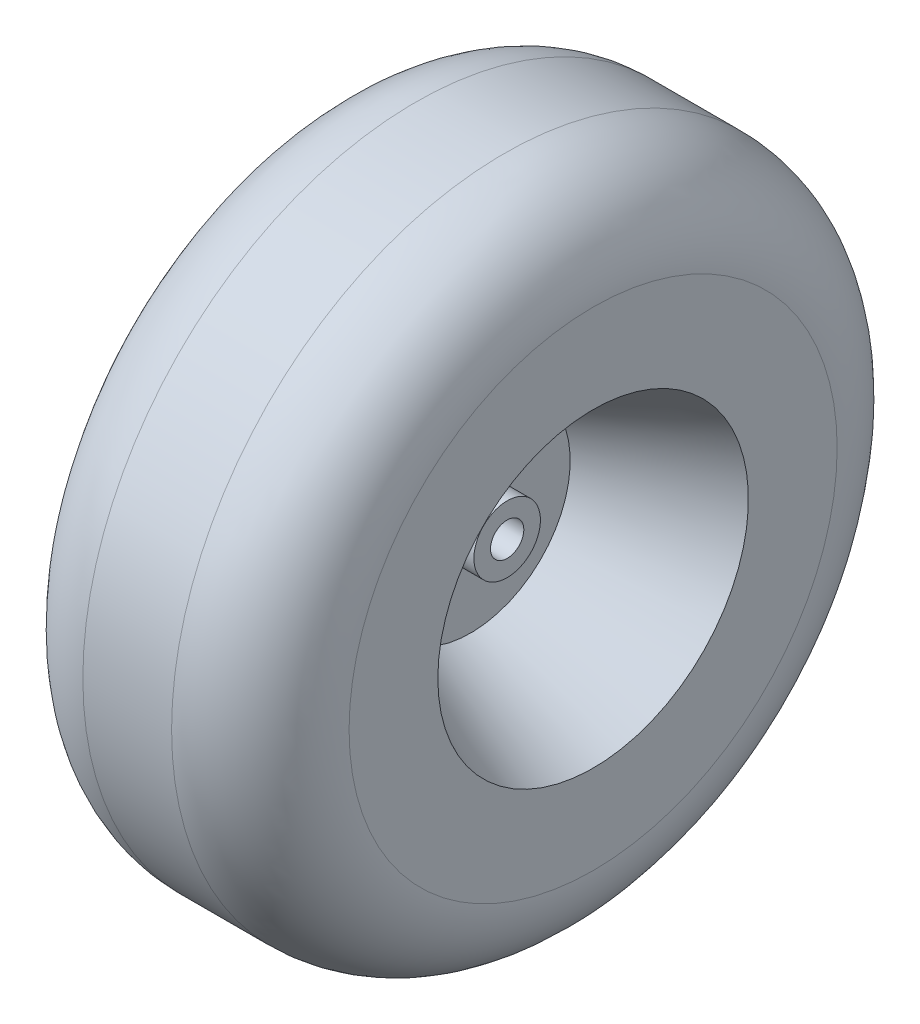
ISO-10303-21;
HEADER;
FILE_DESCRIPTION(('STEP AP214'),'2;1');
FILE_NAME('part.step','',(''),(''),'','','');
FILE_SCHEMA(('AUTOMOTIVE_DESIGN { 1 0 10303 214 1 1 1 1 }'));
ENDSEC;
DATA;
#1=APPLICATION_CONTEXT('core data for automotive mechanical design processes');
#2=APPLICATION_PROTOCOL_DEFINITION('international standard','automotive_design',2000,#1);
#3=PRODUCT_CONTEXT('',#1,'mechanical');
#4=PRODUCT('Part','Part','',(#3));
#5=PRODUCT_RELATED_PRODUCT_CATEGORY('part','',(#4));
#6=PRODUCT_DEFINITION_FORMATION('','',#4);
#7=PRODUCT_DEFINITION_CONTEXT('part definition',#1,'design');
#8=PRODUCT_DEFINITION('design','',#6,#7);
#9=PRODUCT_DEFINITION_SHAPE('','',#8);
#10=(LENGTH_UNIT() NAMED_UNIT(*) SI_UNIT(.MILLI.,.METRE.));
#11=(NAMED_UNIT(*) PLANE_ANGLE_UNIT() SI_UNIT($,.RADIAN.));
#12=(NAMED_UNIT(*) SI_UNIT($,.STERADIAN.) SOLID_ANGLE_UNIT());
#13=UNCERTAINTY_MEASURE_WITH_UNIT(LENGTH_MEASURE(1.E-05),#10,'distance_accuracy_value','');
#14=(GEOMETRIC_REPRESENTATION_CONTEXT(3) GLOBAL_UNCERTAINTY_ASSIGNED_CONTEXT((#13)) GLOBAL_UNIT_ASSIGNED_CONTEXT((#10,
#11,#12)) REPRESENTATION_CONTEXT('',''));
#15=CARTESIAN_POINT('',(0.,0.,0.));
#16=DIRECTION('',(0.,0.,1.));
#17=DIRECTION('',(1.,0.,0.));
#18=AXIS2_PLACEMENT_3D('',#15,#16,#17);
#19=CARTESIAN_POINT('',(76.2,88.9,0.));
#20=DIRECTION('',(-1.,0.,0.));
#21=DIRECTION('',(0.,0.,1.));
#22=AXIS2_PLACEMENT_3D('',#19,#20,#21);
#23=PLANE('',#22);
#24=CARTESIAN_POINT('',(76.2,0.,0.));
#25=DIRECTION('',(-1.,0.,0.));
#26=DIRECTION('',(0.,0.,1.));
#27=AXIS2_PLACEMENT_3D('',#24,#25,#26);
#28=CIRCLE('',#27,139.7);
#29=CARTESIAN_POINT('',(76.2,0.,139.7));
#30=VERTEX_POINT('',#29);
#31=EDGE_CURVE('E80',#30,#30,#28,.T.);
#32=ORIENTED_EDGE('',*,*,#31,.F.);
#33=EDGE_LOOP('',(#32));
#34=FACE_BOUND('',#33,.T.);
#35=CARTESIAN_POINT('',(76.2,0.,0.));
#36=DIRECTION('',(-1.,0.,0.));
#37=DIRECTION('',(0.,0.,1.));
#38=AXIS2_PLACEMENT_3D('',#35,#36,#37);
#39=CIRCLE('',#38,88.9);
#40=CARTESIAN_POINT('',(76.2,0.,88.9));
#41=VERTEX_POINT('',#40);
#42=EDGE_CURVE('E10',#41,#41,#39,.T.);
#43=ORIENTED_EDGE('',*,*,#42,.T.);
#44=EDGE_LOOP('',(#43));
#45=FACE_BOUND('',#44,.T.);
#46=ADVANCED_FACE('F34',(#34,#45),#23,.F.);
#47=CARTESIAN_POINT('',(6.11263969154835,0.,0.));
#48=DIRECTION('',(1.,0.,0.));
#49=DIRECTION('',(0.,0.,-1.));
#50=AXIS2_PLACEMENT_3D('',#47,#48,#49);
#51=CONICAL_SURFACE('',#50,56.9745874149852,0.427425630126478);
#52=ORIENTED_EDGE('',*,*,#42,.F.);
#53=EDGE_LOOP('',(#52));
#54=FACE_BOUND('',#53,.T.);
#55=CARTESIAN_POINT('',(6.11263969154835,0.,0.));
#56=DIRECTION('',(-1.,0.,0.));
#57=DIRECTION('',(0.,0.,1.));
#58=AXIS2_PLACEMENT_3D('',#55,#56,#57);
#59=CIRCLE('',#58,56.9745874149852);
#60=CARTESIAN_POINT('',(6.11263969154835,0.,56.9745874149852));
#61=VERTEX_POINT('',#60);
#62=EDGE_CURVE('E40',#61,#61,#59,.T.);
#63=ORIENTED_EDGE('',*,*,#62,.T.);
#64=EDGE_LOOP('',(#63));
#65=FACE_BOUND('',#64,.T.);
#66=ADVANCED_FACE('F87',(#54,#65),#51,.F.);
#67=CARTESIAN_POINT('',(6.11263969154835,19.05,0.));
#68=DIRECTION('',(-1.,0.,0.));
#69=DIRECTION('',(0.,0.,1.));
#70=AXIS2_PLACEMENT_3D('',#67,#68,#69);
#71=PLANE('',#70);
#72=ORIENTED_EDGE('',*,*,#62,.F.);
#73=EDGE_LOOP('',(#72));
#74=FACE_BOUND('',#73,.T.);
#75=CARTESIAN_POINT('',(6.11263969154835,0.,0.));
#76=DIRECTION('',(-1.,0.,0.));
#77=DIRECTION('',(0.,0.,1.));
#78=AXIS2_PLACEMENT_3D('',#75,#76,#77);
#79=CIRCLE('',#78,19.05);
#80=CARTESIAN_POINT('',(6.11263969154835,0.,19.05));
#81=VERTEX_POINT('',#80);
#82=EDGE_CURVE('E44',#81,#81,#79,.T.);
#83=ORIENTED_EDGE('',*,*,#82,.T.);
#84=EDGE_LOOP('',(#83));
#85=FACE_BOUND('',#84,.T.);
#86=ADVANCED_FACE('F91',(#74,#85),#71,.F.);
#87=CARTESIAN_POINT('',(-76.2,0.,0.));
#88=DIRECTION('',(-1.,0.,0.));
#89=DIRECTION('',(0.,0.,1.));
#90=AXIS2_PLACEMENT_3D('',#87,#88,#89);
#91=CYLINDRICAL_SURFACE('',#90,19.05);
#92=ORIENTED_EDGE('',*,*,#82,.F.);
#93=EDGE_LOOP('',(#92));
#94=FACE_BOUND('',#93,.T.);
#95=CARTESIAN_POINT('',(26.9875,0.,0.));
#96=DIRECTION('',(-1.,0.,0.));
#97=DIRECTION('',(0.,0.,1.));
#98=AXIS2_PLACEMENT_3D('',#95,#96,#97);
#99=CIRCLE('',#98,19.05);
#100=CARTESIAN_POINT('',(26.9875,0.,19.05));
#101=VERTEX_POINT('',#100);
#102=EDGE_CURVE('E48',#101,#101,#99,.T.);
#103=ORIENTED_EDGE('',*,*,#102,.T.);
#104=EDGE_LOOP('',(#103));
#105=FACE_BOUND('',#104,.T.);
#106=ADVANCED_FACE('F96',(#94,#105),#91,.T.);
#107=CARTESIAN_POINT('',(26.9875,9.52500000000001,0.));
#108=DIRECTION('',(-1.,0.,0.));
#109=DIRECTION('',(0.,0.,1.));
#110=AXIS2_PLACEMENT_3D('',#107,#108,#109);
#111=PLANE('',#110);
#112=ORIENTED_EDGE('',*,*,#102,.F.);
#113=EDGE_LOOP('',(#112));
#114=FACE_BOUND('',#113,.T.);
#115=CARTESIAN_POINT('',(26.9875,0.,0.));
#116=DIRECTION('',(-1.,0.,0.));
#117=DIRECTION('',(0.,0.,1.));
#118=AXIS2_PLACEMENT_3D('',#115,#116,#117);
#119=CIRCLE('',#118,9.52500000000001);
#120=CARTESIAN_POINT('',(26.9875,0.,9.52500000000001));
#121=VERTEX_POINT('',#120);
#122=EDGE_CURVE('E53',#121,#121,#119,.T.);
#123=ORIENTED_EDGE('',*,*,#122,.T.);
#124=EDGE_LOOP('',(#123));
#125=FACE_BOUND('',#124,.T.);
#126=ADVANCED_FACE('F102',(#114,#125),#111,.F.);
#127=CARTESIAN_POINT('',(-76.2,0.,0.));
#128=DIRECTION('',(-1.,0.,0.));
#129=DIRECTION('',(0.,0.,1.));
#130=AXIS2_PLACEMENT_3D('',#127,#128,#129);
#131=CYLINDRICAL_SURFACE('',#130,9.52500000000001);
#132=ORIENTED_EDGE('',*,*,#122,.F.);
#133=EDGE_LOOP('',(#132));
#134=FACE_BOUND('',#133,.T.);
#135=CARTESIAN_POINT('',(-26.9875,0.,0.));
#136=DIRECTION('',(-1.,0.,0.));
#137=DIRECTION('',(0.,0.,1.));
#138=AXIS2_PLACEMENT_3D('',#135,#136,#137);
#139=CIRCLE('',#138,9.52500000000001);
#140=CARTESIAN_POINT('',(-26.9875,0.,9.52500000000001));
#141=VERTEX_POINT('',#140);
#142=EDGE_CURVE('E56',#141,#141,#139,.T.);
#143=ORIENTED_EDGE('',*,*,#142,.T.);
#144=EDGE_LOOP('',(#143));
#145=FACE_BOUND('',#144,.T.);
#146=ADVANCED_FACE('F106',(#134,#145),#131,.F.);
#147=CARTESIAN_POINT('',(-26.9875,9.52500000000001,0.));
#148=DIRECTION('',(1.,0.,0.));
#149=DIRECTION('',(0.,0.,-1.));
#150=AXIS2_PLACEMENT_3D('',#147,#148,#149);
#151=PLANE('',#150);
#152=ORIENTED_EDGE('',*,*,#142,.F.);
#153=EDGE_LOOP('',(#152));
#154=FACE_BOUND('',#153,.T.);
#155=CARTESIAN_POINT('',(-26.9875,0.,0.));
#156=DIRECTION('',(-1.,0.,0.));
#157=DIRECTION('',(0.,0.,1.));
#158=AXIS2_PLACEMENT_3D('',#155,#156,#157);
#159=CIRCLE('',#158,19.05);
#160=CARTESIAN_POINT('',(-26.9875,0.,19.05));
#161=VERTEX_POINT('',#160);
#162=EDGE_CURVE('E59',#161,#161,#159,.T.);
#163=ORIENTED_EDGE('',*,*,#162,.T.);
#164=EDGE_LOOP('',(#163));
#165=FACE_BOUND('',#164,.T.);
#166=ADVANCED_FACE('F110',(#154,#165),#151,.F.);
#167=CARTESIAN_POINT('',(-76.2,0.,0.));
#168=DIRECTION('',(-1.,0.,0.));
#169=DIRECTION('',(0.,0.,1.));
#170=AXIS2_PLACEMENT_3D('',#167,#168,#169);
#171=CYLINDRICAL_SURFACE('',#170,19.05);
#172=ORIENTED_EDGE('',*,*,#162,.F.);
#173=EDGE_LOOP('',(#172));
#174=FACE_BOUND('',#173,.T.);
#175=CARTESIAN_POINT('',(-6.11263969154835,0.,0.));
#176=DIRECTION('',(-1.,0.,0.));
#177=DIRECTION('',(0.,0.,1.));
#178=AXIS2_PLACEMENT_3D('',#175,#176,#177);
#179=CIRCLE('',#178,19.05);
#180=CARTESIAN_POINT('',(-6.11263969154835,0.,19.05));
#181=VERTEX_POINT('',#180);
#182=EDGE_CURVE('E62',#181,#181,#179,.T.);
#183=ORIENTED_EDGE('',*,*,#182,.T.);
#184=EDGE_LOOP('',(#183));
#185=FACE_BOUND('',#184,.T.);
#186=ADVANCED_FACE('F114',(#174,#185),#171,.T.);
#187=CARTESIAN_POINT('',(-6.11263969154835,19.05,0.));
#188=DIRECTION('',(1.,0.,0.));
#189=DIRECTION('',(0.,0.,-1.));
#190=AXIS2_PLACEMENT_3D('',#187,#188,#189);
#191=PLANE('',#190);
#192=ORIENTED_EDGE('',*,*,#182,.F.);
#193=EDGE_LOOP('',(#192));
#194=FACE_BOUND('',#193,.T.);
#195=CARTESIAN_POINT('',(-6.11263969154835,0.,0.));
#196=DIRECTION('',(-1.,0.,0.));
#197=DIRECTION('',(0.,0.,1.));
#198=AXIS2_PLACEMENT_3D('',#195,#196,#197);
#199=CIRCLE('',#198,56.9745874149852);
#200=CARTESIAN_POINT('',(-6.11263969154835,0.,56.9745874149852));
#201=VERTEX_POINT('',#200);
#202=EDGE_CURVE('E65',#201,#201,#199,.T.);
#203=ORIENTED_EDGE('',*,*,#202,.T.);
#204=EDGE_LOOP('',(#203));
#205=FACE_BOUND('',#204,.T.);
#206=ADVANCED_FACE('F118',(#194,#205),#191,.F.);
#207=CARTESIAN_POINT('',(-76.2,0.,0.));
#208=DIRECTION('',(-1.,0.,0.));
#209=DIRECTION('',(0.,0.,1.));
#210=AXIS2_PLACEMENT_3D('',#207,#208,#209);
#211=CONICAL_SURFACE('',#210,88.9,0.427425630126478);
#212=ORIENTED_EDGE('',*,*,#202,.F.);
#213=EDGE_LOOP('',(#212));
#214=FACE_BOUND('',#213,.T.);
#215=CARTESIAN_POINT('',(-76.2,0.,0.));
#216=DIRECTION('',(-1.,0.,0.));
#217=DIRECTION('',(0.,0.,1.));
#218=AXIS2_PLACEMENT_3D('',#215,#216,#217);
#219=CIRCLE('',#218,88.9);
#220=CARTESIAN_POINT('',(-76.2,0.,88.9));
#221=VERTEX_POINT('',#220);
#222=EDGE_CURVE('E68',#221,#221,#219,.T.);
#223=ORIENTED_EDGE('',*,*,#222,.T.);
#224=EDGE_LOOP('',(#223));
#225=FACE_BOUND('',#224,.T.);
#226=ADVANCED_FACE('F122',(#214,#225),#211,.F.);
#227=CARTESIAN_POINT('',(-76.2,88.9,0.));
#228=DIRECTION('',(1.,0.,0.));
#229=DIRECTION('',(0.,0.,-1.));
#230=AXIS2_PLACEMENT_3D('',#227,#228,#229);
#231=PLANE('',#230);
#232=ORIENTED_EDGE('',*,*,#222,.F.);
#233=EDGE_LOOP('',(#232));
#234=FACE_BOUND('',#233,.T.);
#235=CARTESIAN_POINT('',(-76.2,0.,0.));
#236=DIRECTION('',(-1.,0.,0.));
#237=DIRECTION('',(0.,0.,1.));
#238=AXIS2_PLACEMENT_3D('',#235,#236,#237);
#239=CIRCLE('',#238,139.7);
#240=CARTESIAN_POINT('',(-76.2,0.,139.7));
#241=VERTEX_POINT('',#240);
#242=EDGE_CURVE('E71',#241,#241,#239,.T.);
#243=ORIENTED_EDGE('',*,*,#242,.T.);
#244=EDGE_LOOP('',(#243));
#245=FACE_BOUND('',#244,.T.);
#246=ADVANCED_FACE('F126',(#234,#245),#231,.F.);
#247=CARTESIAN_POINT('',(-25.4,0.,0.));
#248=DIRECTION('',(-1.,0.,0.));
#249=DIRECTION('',(0.,0.,1.));
#250=AXIS2_PLACEMENT_3D('',#247,#248,#249);
#251=TOROIDAL_SURFACE('',#250,139.7,50.8);
#252=ORIENTED_EDGE('',*,*,#242,.F.);
#253=EDGE_LOOP('',(#252));
#254=FACE_BOUND('',#253,.T.);
#255=CARTESIAN_POINT('',(-25.4,0.,0.));
#256=DIRECTION('',(-1.,0.,0.));
#257=DIRECTION('',(0.,0.,1.));
#258=AXIS2_PLACEMENT_3D('',#255,#256,#257);
#259=CIRCLE('',#258,190.5);
#260=CARTESIAN_POINT('',(-25.4,0.,190.5));
#261=VERTEX_POINT('',#260);
#262=EDGE_CURVE('E74',#261,#261,#259,.T.);
#263=ORIENTED_EDGE('',*,*,#262,.T.);
#264=EDGE_LOOP('',(#263));
#265=FACE_BOUND('',#264,.T.);
#266=ADVANCED_FACE('F130',(#254,#265),#251,.T.);
#267=CARTESIAN_POINT('',(-76.2,0.,0.));
#268=DIRECTION('',(-1.,0.,0.));
#269=DIRECTION('',(0.,0.,1.));
#270=AXIS2_PLACEMENT_3D('',#267,#268,#269);
#271=CYLINDRICAL_SURFACE('',#270,190.5);
#272=ORIENTED_EDGE('',*,*,#262,.F.);
#273=EDGE_LOOP('',(#272));
#274=FACE_BOUND('',#273,.T.);
#275=CARTESIAN_POINT('',(25.4,0.,0.));
#276=DIRECTION('',(-1.,0.,0.));
#277=DIRECTION('',(0.,0.,1.));
#278=AXIS2_PLACEMENT_3D('',#275,#276,#277);
#279=CIRCLE('',#278,190.5);
#280=CARTESIAN_POINT('',(25.4,0.,190.5));
#281=VERTEX_POINT('',#280);
#282=EDGE_CURVE('E77',#281,#281,#279,.T.);
#283=ORIENTED_EDGE('',*,*,#282,.T.);
#284=EDGE_LOOP('',(#283));
#285=FACE_BOUND('',#284,.T.);
#286=ADVANCED_FACE('F134',(#274,#285),#271,.T.);
#287=CARTESIAN_POINT('',(25.4,0.,0.));
#288=DIRECTION('',(-1.,0.,0.));
#289=DIRECTION('',(0.,0.,1.));
#290=AXIS2_PLACEMENT_3D('',#287,#288,#289);
#291=TOROIDAL_SURFACE('',#290,139.7,50.8);
#292=ORIENTED_EDGE('',*,*,#282,.F.);
#293=EDGE_LOOP('',(#292));
#294=FACE_BOUND('',#293,.T.);
#295=ORIENTED_EDGE('',*,*,#31,.T.);
#296=EDGE_LOOP('',(#295));
#297=FACE_BOUND('',#296,.T.);
#298=ADVANCED_FACE('F84',(#294,#297),#291,.T.);
#299=CLOSED_SHELL('',(#46,#66,#86,#106,#126,#146,#166,#186,#206,#226,#246,#266,#286,#298));
#300=MANIFOLD_SOLID_BREP('B2',#299);
#301=ADVANCED_BREP_SHAPE_REPRESENTATION('',(#18,#300),#14);
#302=SHAPE_DEFINITION_REPRESENTATION(#9,#301);
ENDSEC;
END-ISO-10303-21;
